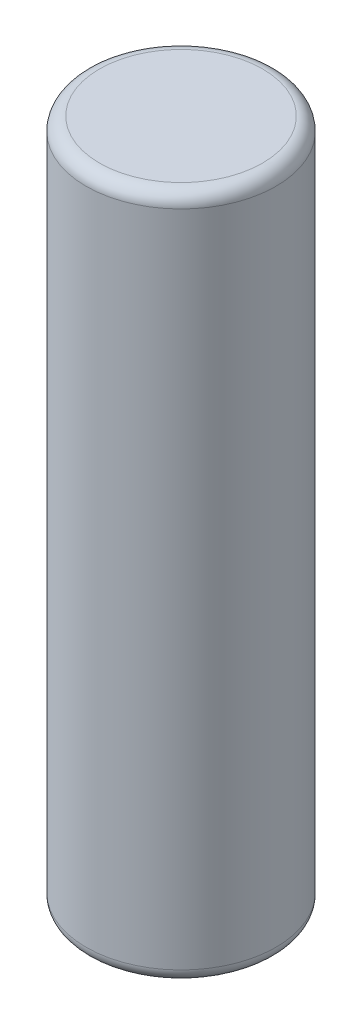
ISO-10303-21;
HEADER;
FILE_DESCRIPTION(('STEP AP214'),'2;1');
FILE_NAME('part.step','',(''),(''),'','','');
FILE_SCHEMA(('AUTOMOTIVE_DESIGN { 1 0 10303 214 1 1 1 1 }'));
ENDSEC;
DATA;
#1=APPLICATION_CONTEXT('core data for automotive mechanical design processes');
#2=APPLICATION_PROTOCOL_DEFINITION('international standard','automotive_design',2000,#1);
#3=PRODUCT_CONTEXT('',#1,'mechanical');
#4=PRODUCT('Part','Part','',(#3));
#5=PRODUCT_RELATED_PRODUCT_CATEGORY('part','',(#4));
#6=PRODUCT_DEFINITION_FORMATION('','',#4);
#7=PRODUCT_DEFINITION_CONTEXT('part definition',#1,'design');
#8=PRODUCT_DEFINITION('design','',#6,#7);
#9=PRODUCT_DEFINITION_SHAPE('','',#8);
#10=(LENGTH_UNIT() NAMED_UNIT(*) SI_UNIT(.MILLI.,.METRE.));
#11=(NAMED_UNIT(*) PLANE_ANGLE_UNIT() SI_UNIT($,.RADIAN.));
#12=(NAMED_UNIT(*) SI_UNIT($,.STERADIAN.) SOLID_ANGLE_UNIT());
#13=UNCERTAINTY_MEASURE_WITH_UNIT(LENGTH_MEASURE(1.E-05),#10,'distance_accuracy_value','');
#14=(GEOMETRIC_REPRESENTATION_CONTEXT(3) GLOBAL_UNCERTAINTY_ASSIGNED_CONTEXT((#13)) GLOBAL_UNIT_ASSIGNED_CONTEXT((#10,
#11,#12)) REPRESENTATION_CONTEXT('',''));
#15=CARTESIAN_POINT('',(0.,0.,0.));
#16=DIRECTION('',(0.,0.,1.));
#17=DIRECTION('',(1.,0.,0.));
#18=AXIS2_PLACEMENT_3D('',#15,#16,#17);
#19=CARTESIAN_POINT('',(5.68989300120393E-13,65.,-3.33066907387547E-13));
#20=DIRECTION('',(0.,-1.,0.));
#21=DIRECTION('',(0.,0.,-0.999999999999995));
#22=AXIS2_PLACEMENT_3D('',#19,#20,#21);
#23=CYLINDRICAL_SURFACE('',#22,9.);
#24=CARTESIAN_POINT('',(0.,1.26999999999999,3.88578058618805E-13));
#25=DIRECTION('',(0.,1.,0.));
#26=DIRECTION('',(0.,0.,0.999999999999995));
#27=AXIS2_PLACEMENT_3D('',#24,#25,#26);
#28=CIRCLE('',#27,9.);
#29=CARTESIAN_POINT('',(0.,1.26999999999999,9.00000000000034));
#30=VERTEX_POINT('',#29);
#31=EDGE_CURVE('E56',#30,#30,#28,.T.);
#32=ORIENTED_EDGE('',*,*,#31,.T.);
#33=EDGE_LOOP('',(#32));
#34=FACE_BOUND('',#33,.T.);
#35=CARTESIAN_POINT('',(6.38378239159465E-13,63.73,-3.33066907387547E-13));
#36=DIRECTION('',(0.,1.,0.));
#37=DIRECTION('',(0.,0.,0.999999999999995));
#38=AXIS2_PLACEMENT_3D('',#35,#36,#37);
#39=CIRCLE('',#38,9.);
#40=CARTESIAN_POINT('',(6.14897022188643E-13,63.73,8.99999999999962));
#41=VERTEX_POINT('',#40);
#42=EDGE_CURVE('E60',#41,#41,#39,.F.);
#43=ORIENTED_EDGE('',*,*,#42,.T.);
#44=EDGE_LOOP('',(#43));
#45=FACE_BOUND('',#44,.T.);
#46=ADVANCED_FACE('F45',(#34,#45),#23,.T.);
#47=CARTESIAN_POINT('',(5.68989300120393E-13,65.,-3.33066907387547E-13));
#48=DIRECTION('',(0.,1.,0.));
#49=DIRECTION('',(0.,0.,0.999999999999995));
#50=AXIS2_PLACEMENT_3D('',#47,#48,#49);
#51=PLANE('',#50);
#52=CARTESIAN_POINT('',(5.68989300120393E-13,65.,-3.33066907387547E-13));
#53=DIRECTION('',(0.,1.,0.));
#54=DIRECTION('',(0.,0.,0.999999999999995));
#55=AXIS2_PLACEMENT_3D('',#52,#53,#54);
#56=CIRCLE('',#55,7.73);
#57=CARTESIAN_POINT('',(5.48821543766564E-13,65.,7.72999999999963));
#58=VERTEX_POINT('',#57);
#59=EDGE_CURVE('E10',#58,#58,#56,.T.);
#60=ORIENTED_EDGE('',*,*,#59,.T.);
#61=EDGE_LOOP('',(#60));
#62=FACE_BOUND('',#61,.T.);
#63=ADVANCED_FACE('F76',(#62),#51,.T.);
#64=CARTESIAN_POINT('',(0.,0.,0.));
#65=DIRECTION('',(0.,1.,0.));
#66=DIRECTION('',(0.,0.,0.999999999999995));
#67=AXIS2_PLACEMENT_3D('',#64,#65,#66);
#68=PLANE('',#67);
#69=CARTESIAN_POINT('',(0.,0.,0.));
#70=DIRECTION('',(0.,1.,0.));
#71=DIRECTION('',(0.,0.,0.999999999999995));
#72=AXIS2_PLACEMENT_3D('',#69,#70,#71);
#73=CIRCLE('',#72,7.73);
#74=CARTESIAN_POINT('',(0.,0.,7.72999999999996));
#75=VERTEX_POINT('',#74);
#76=EDGE_CURVE('E52',#75,#75,#73,.F.);
#77=ORIENTED_EDGE('',*,*,#76,.T.);
#78=EDGE_LOOP('',(#77));
#79=FACE_BOUND('',#78,.T.);
#80=ADVANCED_FACE('F73',(#79),#68,.F.);
#81=CARTESIAN_POINT('',(0.,1.26999999999999,3.88578058618805E-13));
#82=DIRECTION('',(0.,1.,0.));
#83=DIRECTION('',(0.,0.,0.999999999999995));
#84=AXIS2_PLACEMENT_3D('',#81,#82,#83);
#85=TOROIDAL_SURFACE('',#84,7.73,1.27);
#86=ORIENTED_EDGE('',*,*,#76,.F.);
#87=EDGE_LOOP('',(#86));
#88=FACE_BOUND('',#87,.T.);
#89=ORIENTED_EDGE('',*,*,#31,.F.);
#90=EDGE_LOOP('',(#89));
#91=FACE_BOUND('',#90,.T.);
#92=ADVANCED_FACE('F69',(#88,#91),#85,.T.);
#93=CARTESIAN_POINT('',(6.38378239159465E-13,63.73,-3.33066907387547E-13));
#94=DIRECTION('',(0.,1.,0.));
#95=DIRECTION('',(0.,0.,0.999999999999995));
#96=AXIS2_PLACEMENT_3D('',#93,#94,#95);
#97=TOROIDAL_SURFACE('',#96,7.73,1.27);
#98=ORIENTED_EDGE('',*,*,#42,.F.);
#99=EDGE_LOOP('',(#98));
#100=FACE_BOUND('',#99,.T.);
#101=ORIENTED_EDGE('',*,*,#59,.F.);
#102=EDGE_LOOP('',(#101));
#103=FACE_BOUND('',#102,.T.);
#104=ADVANCED_FACE('F47',(#100,#103),#97,.T.);
#105=CLOSED_SHELL('',(#46,#63,#80,#92,#104));
#106=MANIFOLD_SOLID_BREP('B2',#105);
#107=ADVANCED_BREP_SHAPE_REPRESENTATION('',(#18,#106),#14);
#108=SHAPE_DEFINITION_REPRESENTATION(#9,#107);
ENDSEC;
END-ISO-10303-21;
